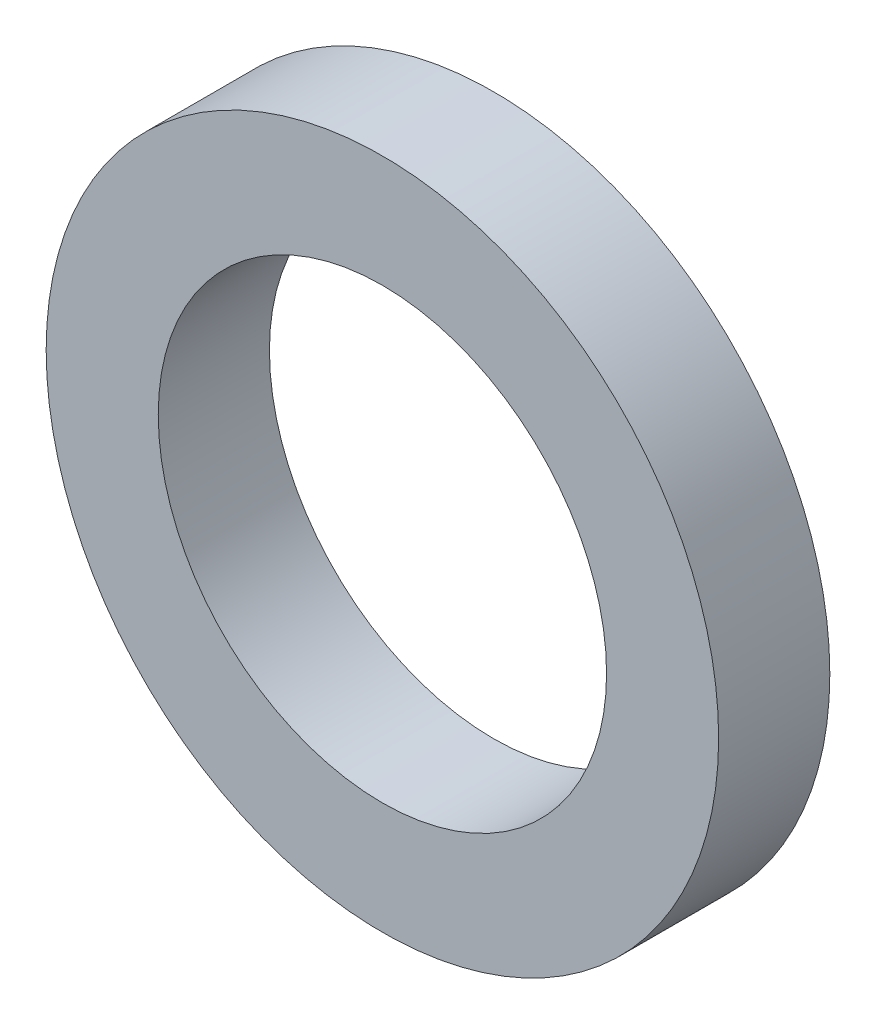
ISO-10303-21;
HEADER;
FILE_DESCRIPTION(('STEP AP214'),'2;1');
FILE_NAME('part.step','',(''),(''),'','','');
FILE_SCHEMA(('AUTOMOTIVE_DESIGN { 1 0 10303 214 1 1 1 1 }'));
ENDSEC;
DATA;
#1=APPLICATION_CONTEXT('core data for automotive mechanical design processes');
#2=APPLICATION_PROTOCOL_DEFINITION('international standard','automotive_design',2000,#1);
#3=PRODUCT_CONTEXT('',#1,'mechanical');
#4=PRODUCT('Part','Part','',(#3));
#5=PRODUCT_RELATED_PRODUCT_CATEGORY('part','',(#4));
#6=PRODUCT_DEFINITION_FORMATION('','',#4);
#7=PRODUCT_DEFINITION_CONTEXT('part definition',#1,'design');
#8=PRODUCT_DEFINITION('design','',#6,#7);
#9=PRODUCT_DEFINITION_SHAPE('','',#8);
#10=(LENGTH_UNIT() NAMED_UNIT(*) SI_UNIT(.MILLI.,.METRE.));
#11=(NAMED_UNIT(*) PLANE_ANGLE_UNIT() SI_UNIT($,.RADIAN.));
#12=(NAMED_UNIT(*) SI_UNIT($,.STERADIAN.) SOLID_ANGLE_UNIT());
#13=UNCERTAINTY_MEASURE_WITH_UNIT(LENGTH_MEASURE(1.E-05),#10,'distance_accuracy_value','');
#14=(GEOMETRIC_REPRESENTATION_CONTEXT(3) GLOBAL_UNCERTAINTY_ASSIGNED_CONTEXT((#13)) GLOBAL_UNIT_ASSIGNED_CONTEXT((#10,
#11,#12)) REPRESENTATION_CONTEXT('',''));
#15=CARTESIAN_POINT('',(0.,0.,0.));
#16=DIRECTION('',(0.,0.,1.));
#17=DIRECTION('',(1.,0.,0.));
#18=AXIS2_PLACEMENT_3D('',#15,#16,#17);
#19=CARTESIAN_POINT('',(0.,0.,1.5748));
#20=DIRECTION('',(0.,0.,1.));
#21=DIRECTION('',(1.,0.,0.));
#22=AXIS2_PLACEMENT_3D('',#19,#20,#21);
#23=PLANE('',#22);
#24=CARTESIAN_POINT('',(0.,0.,1.5748));
#25=DIRECTION('',(0.,0.,1.));
#26=DIRECTION('',(1.,0.,0.));
#27=AXIS2_PLACEMENT_3D('',#24,#25,#26);
#28=CIRCLE('',#27,4.7625);
#29=CARTESIAN_POINT('',(4.7625,0.,1.5748));
#30=VERTEX_POINT('',#29);
#31=EDGE_CURVE('E10',#30,#30,#28,.T.);
#32=ORIENTED_EDGE('',*,*,#31,.T.);
#33=EDGE_LOOP('',(#32));
#34=FACE_BOUND('',#33,.T.);
#35=CARTESIAN_POINT('',(0.,0.,1.5748));
#36=DIRECTION('',(0.,0.,1.));
#37=DIRECTION('',(1.,0.,0.));
#38=AXIS2_PLACEMENT_3D('',#35,#36,#37);
#39=CIRCLE('',#38,3.175);
#40=CARTESIAN_POINT('',(3.175,0.,1.5748));
#41=VERTEX_POINT('',#40);
#42=EDGE_CURVE('E42',#41,#41,#39,.T.);
#43=ORIENTED_EDGE('',*,*,#42,.F.);
#44=EDGE_LOOP('',(#43));
#45=FACE_BOUND('',#44,.T.);
#46=ADVANCED_FACE('F31',(#34,#45),#23,.T.);
#47=CARTESIAN_POINT('',(0.,0.,0.));
#48=DIRECTION('',(0.,0.,1.));
#49=DIRECTION('',(1.,0.,0.));
#50=AXIS2_PLACEMENT_3D('',#47,#48,#49);
#51=PLANE('',#50);
#52=CARTESIAN_POINT('',(0.,0.,0.));
#53=DIRECTION('',(0.,0.,1.));
#54=DIRECTION('',(1.,0.,0.));
#55=AXIS2_PLACEMENT_3D('',#52,#53,#54);
#56=CIRCLE('',#55,4.7625);
#57=CARTESIAN_POINT('',(4.7625,0.,0.));
#58=VERTEX_POINT('',#57);
#59=EDGE_CURVE('E35',#58,#58,#56,.T.);
#60=ORIENTED_EDGE('',*,*,#59,.F.);
#61=EDGE_LOOP('',(#60));
#62=FACE_BOUND('',#61,.T.);
#63=CARTESIAN_POINT('',(0.,0.,0.));
#64=DIRECTION('',(0.,0.,1.));
#65=DIRECTION('',(1.,0.,0.));
#66=AXIS2_PLACEMENT_3D('',#63,#64,#65);
#67=CIRCLE('',#66,3.175);
#68=CARTESIAN_POINT('',(3.175,0.,0.));
#69=VERTEX_POINT('',#68);
#70=EDGE_CURVE('E44',#69,#69,#67,.T.);
#71=ORIENTED_EDGE('',*,*,#70,.T.);
#72=EDGE_LOOP('',(#71));
#73=FACE_BOUND('',#72,.T.);
#74=ADVANCED_FACE('F54',(#62,#73),#51,.F.);
#75=CARTESIAN_POINT('',(0.,0.,1.5748));
#76=DIRECTION('',(0.,0.,-1.));
#77=DIRECTION('',(-1.,0.,0.));
#78=AXIS2_PLACEMENT_3D('',#75,#76,#77);
#79=CYLINDRICAL_SURFACE('',#78,4.7625);
#80=ORIENTED_EDGE('',*,*,#31,.F.);
#81=EDGE_LOOP('',(#80));
#82=FACE_BOUND('',#81,.T.);
#83=ORIENTED_EDGE('',*,*,#59,.T.);
#84=EDGE_LOOP('',(#83));
#85=FACE_BOUND('',#84,.T.);
#86=ADVANCED_FACE('F33',(#82,#85),#79,.T.);
#87=CARTESIAN_POINT('',(0.,0.,1.5748));
#88=DIRECTION('',(0.,0.,-1.));
#89=DIRECTION('',(-1.,0.,0.));
#90=AXIS2_PLACEMENT_3D('',#87,#88,#89);
#91=CYLINDRICAL_SURFACE('',#90,3.175);
#92=ORIENTED_EDGE('',*,*,#42,.T.);
#93=EDGE_LOOP('',(#92));
#94=FACE_BOUND('',#93,.T.);
#95=ORIENTED_EDGE('',*,*,#70,.F.);
#96=EDGE_LOOP('',(#95));
#97=FACE_BOUND('',#96,.T.);
#98=ADVANCED_FACE('F50',(#94,#97),#91,.F.);
#99=CLOSED_SHELL('',(#46,#74,#86,#98));
#100=MANIFOLD_SOLID_BREP('B2',#99);
#101=ADVANCED_BREP_SHAPE_REPRESENTATION('',(#18,#100),#14);
#102=SHAPE_DEFINITION_REPRESENTATION(#9,#101);
ENDSEC;
END-ISO-10303-21;
